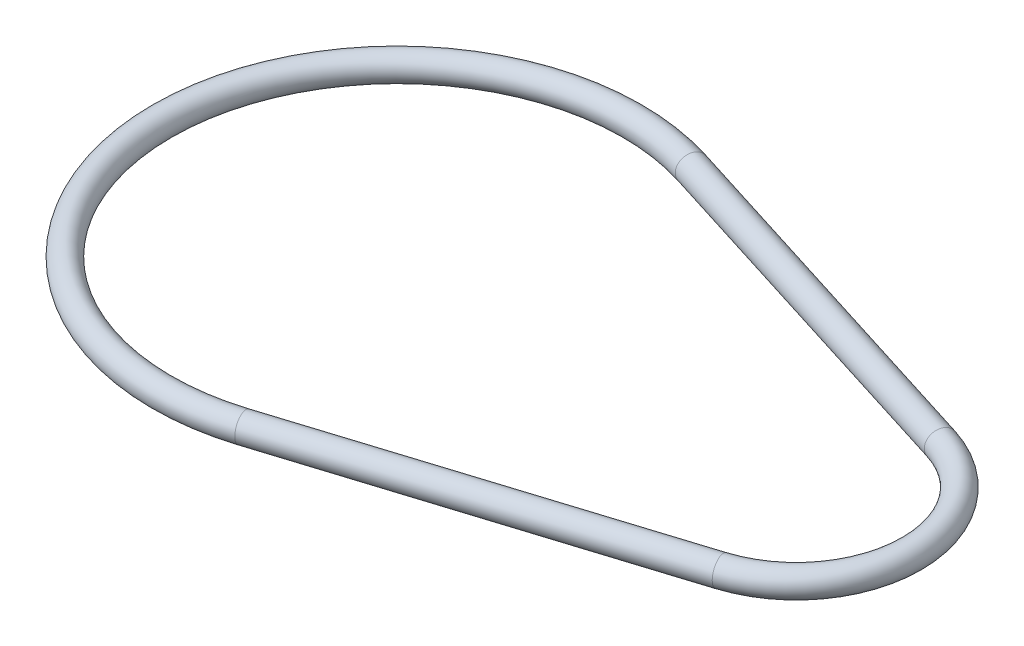
ISO-10303-21;
HEADER;
FILE_DESCRIPTION(('STEP AP214'),'2;1');
FILE_NAME('part.step','',(''),(''),'','','');
FILE_SCHEMA(('AUTOMOTIVE_DESIGN { 1 0 10303 214 1 1 1 1 }'));
ENDSEC;
DATA;
#1=APPLICATION_CONTEXT('core data for automotive mechanical design processes');
#2=APPLICATION_PROTOCOL_DEFINITION('international standard','automotive_design',2000,#1);
#3=PRODUCT_CONTEXT('',#1,'mechanical');
#4=PRODUCT('Part','Part','',(#3));
#5=PRODUCT_RELATED_PRODUCT_CATEGORY('part','',(#4));
#6=PRODUCT_DEFINITION_FORMATION('','',#4);
#7=PRODUCT_DEFINITION_CONTEXT('part definition',#1,'design');
#8=PRODUCT_DEFINITION('design','',#6,#7);
#9=PRODUCT_DEFINITION_SHAPE('','',#8);
#10=(LENGTH_UNIT() NAMED_UNIT(*) SI_UNIT(.MILLI.,.METRE.));
#11=(NAMED_UNIT(*) PLANE_ANGLE_UNIT() SI_UNIT($,.RADIAN.));
#12=(NAMED_UNIT(*) SI_UNIT($,.STERADIAN.) SOLID_ANGLE_UNIT());
#13=UNCERTAINTY_MEASURE_WITH_UNIT(LENGTH_MEASURE(1.E-05),#10,'distance_accuracy_value','');
#14=(GEOMETRIC_REPRESENTATION_CONTEXT(3) GLOBAL_UNCERTAINTY_ASSIGNED_CONTEXT((#13)) GLOBAL_UNIT_ASSIGNED_CONTEXT((#10,
#11,#12)) REPRESENTATION_CONTEXT('',''));
#15=CARTESIAN_POINT('',(0.,0.,0.));
#16=DIRECTION('',(0.,0.,1.));
#17=DIRECTION('',(1.,0.,0.));
#18=AXIS2_PLACEMENT_3D('',#15,#16,#17);
#19=CARTESIAN_POINT('',(45.,0.,0.));
#20=DIRECTION('',(0.,-1.,0.));
#21=DIRECTION('',(0.,0.,-1.));
#22=AXIS2_PLACEMENT_3D('',#19,#20,#21);
#23=TOROIDAL_SURFACE('',#22,13.,1.5);
#24=CARTESIAN_POINT('',(48.9,0.,-12.4012096184203));
#25=DIRECTION('',(-0.953939201416946,0.,-0.3));
#26=DIRECTION('',(-0.3,0.,0.953939201416946));
#27=AXIS2_PLACEMENT_3D('',#24,#25,#26);
#28=CIRCLE('',#27,1.5);
#29=CARTESIAN_POINT('',(49.35,0.,-13.8321184205457));
#30=VERTEX_POINT('',#29);
#31=EDGE_CURVE('E60',#30,#30,#28,.T.);
#32=CARTESIAN_POINT('',(48.9,0.,12.4012096184203));
#33=DIRECTION('',(0.953939201416946,0.,-0.3));
#34=DIRECTION('',(-0.3,0.,-0.953939201416946));
#35=AXIS2_PLACEMENT_3D('',#32,#33,#34);
#36=CIRCLE('',#35,1.5);
#37=CARTESIAN_POINT('',(49.35,0.,13.8321184205457));
#38=VERTEX_POINT('',#37);
#39=EDGE_CURVE('E56',#38,#38,#36,.T.);
#40=CARTESIAN_POINT('',(45.,0.,0.));
#41=DIRECTION('',(0.,-1.,0.));
#42=DIRECTION('',(0.,0.,-1.));
#43=AXIS2_PLACEMENT_3D('',#40,#41,#42);
#44=CIRCLE('',#43,14.5);
#45=EDGE_CURVE('',#30,#38,#44,.T.);
#46=ORIENTED_EDGE('',*,*,#31,.F.);
#47=ORIENTED_EDGE('',*,*,#39,.T.);
#48=ORIENTED_EDGE('',*,*,#45,.T.);
#49=ORIENTED_EDGE('',*,*,#45,.F.);
#50=EDGE_LOOP('',(#46,#48,#47,#49));
#51=FACE_BOUND('',#50,.T.);
#52=ADVANCED_FACE('F45',(#51),#23,.T.);
#53=CARTESIAN_POINT('',(48.9,0.,12.4012096184203));
#54=DIRECTION('',(-0.953939201416946,0.,0.3));
#55=DIRECTION('',(0.3,0.,0.953939201416946));
#56=AXIS2_PLACEMENT_3D('',#53,#54,#55);
#57=CYLINDRICAL_SURFACE('',#56,1.5);
#58=CARTESIAN_POINT('',(7.95,0.,25.2793888375491));
#59=DIRECTION('',(0.953939201416946,0.,-0.299999999999999));
#60=DIRECTION('',(-0.299999999999999,0.,-0.953939201416946));
#61=AXIS2_PLACEMENT_3D('',#58,#59,#60);
#62=CIRCLE('',#61,1.5);
#63=CARTESIAN_POINT('',(8.4,0.,26.7102976396745));
#64=VERTEX_POINT('',#63);
#65=EDGE_CURVE('E52',#64,#64,#62,.T.);
#66=ORIENTED_EDGE('',*,*,#65,.T.);
#67=EDGE_LOOP('',(#66));
#68=FACE_BOUND('',#67,.T.);
#69=ORIENTED_EDGE('',*,*,#39,.F.);
#70=EDGE_LOOP('',(#69));
#71=FACE_BOUND('',#70,.T.);
#72=ADVANCED_FACE('F69',(#68,#71),#57,.T.);
#73=CARTESIAN_POINT('',(0.,0.,0.));
#74=DIRECTION('',(0.,-1.,0.));
#75=DIRECTION('',(0.,0.,-1.));
#76=AXIS2_PLACEMENT_3D('',#73,#74,#75);
#77=TOROIDAL_SURFACE('',#76,26.5,1.5);
#78=CARTESIAN_POINT('',(7.94999999999999,0.,-25.2793888375491));
#79=DIRECTION('',(-0.953939201416946,0.,-0.3));
#80=DIRECTION('',(-0.3,0.,0.953939201416946));
#81=AXIS2_PLACEMENT_3D('',#78,#79,#80);
#82=CIRCLE('',#81,1.5);
#83=CARTESIAN_POINT('',(8.39999999999999,0.,-26.7102976396745));
#84=VERTEX_POINT('',#83);
#85=EDGE_CURVE('E11',#84,#84,#82,.T.);
#86=CARTESIAN_POINT('',(0.,0.,0.));
#87=DIRECTION('',(0.,-1.,0.));
#88=DIRECTION('',(0.,0.,-1.));
#89=AXIS2_PLACEMENT_3D('',#86,#87,#88);
#90=CIRCLE('',#89,28.);
#91=EDGE_CURVE('',#64,#84,#90,.T.);
#92=ORIENTED_EDGE('',*,*,#65,.F.);
#93=ORIENTED_EDGE('',*,*,#85,.T.);
#94=ORIENTED_EDGE('',*,*,#91,.T.);
#95=ORIENTED_EDGE('',*,*,#91,.F.);
#96=EDGE_LOOP('',(#92,#94,#93,#95));
#97=FACE_BOUND('',#96,.T.);
#98=ADVANCED_FACE('F75',(#97),#77,.T.);
#99=CARTESIAN_POINT('',(7.94999999999999,0.,-25.2793888375491));
#100=DIRECTION('',(0.953939201416946,0.,0.3));
#101=DIRECTION('',(0.3,0.,-0.953939201416946));
#102=AXIS2_PLACEMENT_3D('',#99,#100,#101);
#103=CYLINDRICAL_SURFACE('',#102,1.5);
#104=ORIENTED_EDGE('',*,*,#31,.T.);
#105=EDGE_LOOP('',(#104));
#106=FACE_BOUND('',#105,.T.);
#107=ORIENTED_EDGE('',*,*,#85,.F.);
#108=EDGE_LOOP('',(#107));
#109=FACE_BOUND('',#108,.T.);
#110=ADVANCED_FACE('F47',(#106,#109),#103,.T.);
#111=CLOSED_SHELL('',(#52,#72,#98,#110));
#112=MANIFOLD_SOLID_BREP('B2',#111);
#113=ADVANCED_BREP_SHAPE_REPRESENTATION('',(#18,#112),#14);
#114=SHAPE_DEFINITION_REPRESENTATION(#9,#113);
ENDSEC;
END-ISO-10303-21;
